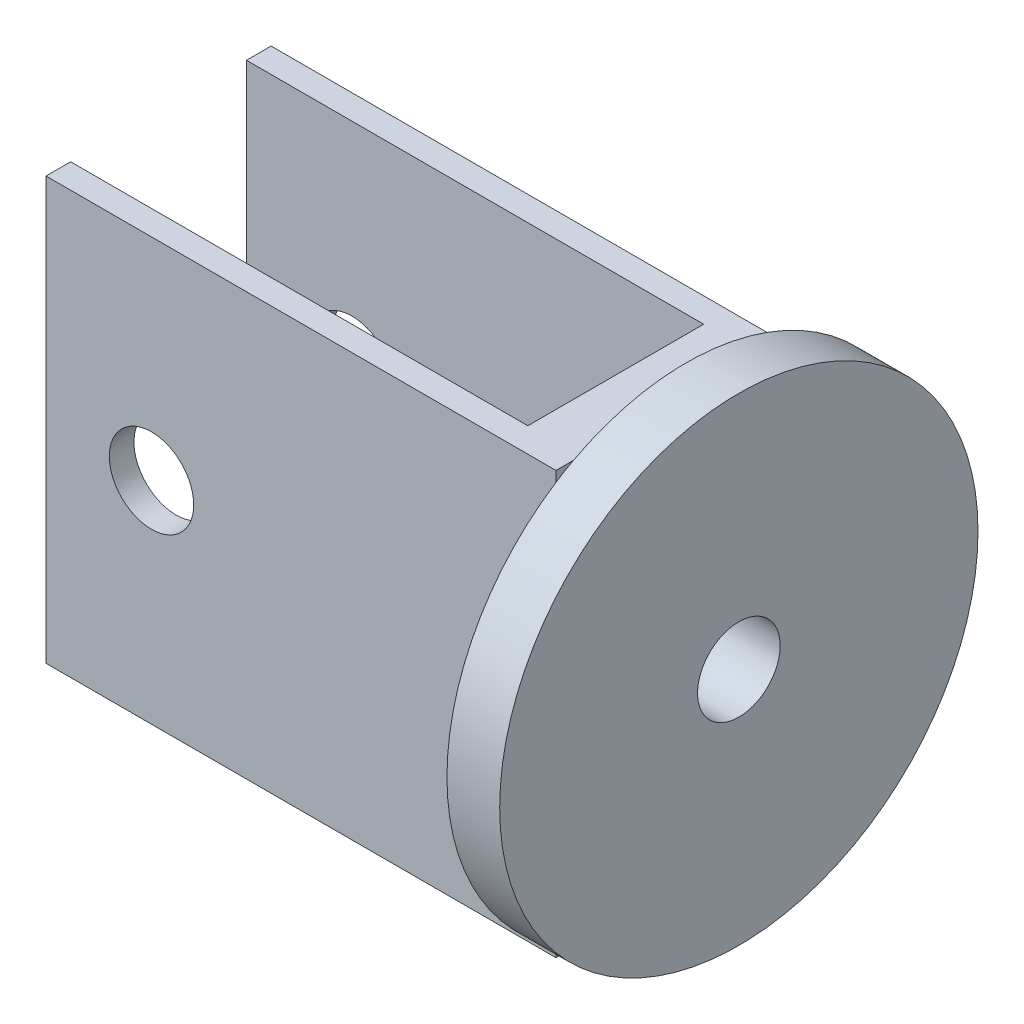
ISO-10303-21;
HEADER;
FILE_DESCRIPTION(('STEP AP214'),'2;1');
FILE_NAME('part.step','',(''),(''),'','','');
FILE_SCHEMA(('AUTOMOTIVE_DESIGN { 1 0 10303 214 1 1 1 1 }'));
ENDSEC;
DATA;
#1=APPLICATION_CONTEXT('core data for automotive mechanical design processes');
#2=APPLICATION_PROTOCOL_DEFINITION('international standard','automotive_design',2000,#1);
#3=PRODUCT_CONTEXT('',#1,'mechanical');
#4=PRODUCT('Part','Part','',(#3));
#5=PRODUCT_RELATED_PRODUCT_CATEGORY('part','',(#4));
#6=PRODUCT_DEFINITION_FORMATION('','',#4);
#7=PRODUCT_DEFINITION_CONTEXT('part definition',#1,'design');
#8=PRODUCT_DEFINITION('design','',#6,#7);
#9=PRODUCT_DEFINITION_SHAPE('','',#8);
#10=(LENGTH_UNIT() NAMED_UNIT(*) SI_UNIT(.MILLI.,.METRE.));
#11=(NAMED_UNIT(*) PLANE_ANGLE_UNIT() SI_UNIT($,.RADIAN.));
#12=(NAMED_UNIT(*) SI_UNIT($,.STERADIAN.) SOLID_ANGLE_UNIT());
#13=UNCERTAINTY_MEASURE_WITH_UNIT(LENGTH_MEASURE(1.E-05),#10,'distance_accuracy_value','');
#14=(GEOMETRIC_REPRESENTATION_CONTEXT(3) GLOBAL_UNCERTAINTY_ASSIGNED_CONTEXT((#13)) GLOBAL_UNIT_ASSIGNED_CONTEXT((#10,
#11,#12)) REPRESENTATION_CONTEXT('',''));
#15=CARTESIAN_POINT('',(0.,0.,0.));
#16=DIRECTION('',(0.,0.,1.));
#17=DIRECTION('',(1.,0.,0.));
#18=AXIS2_PLACEMENT_3D('',#15,#16,#17);
#19=CARTESIAN_POINT('',(231.06736811296,120.,64.6310627072017));
#20=DIRECTION('',(1.,0.,0.));
#21=DIRECTION('',(0.,0.,-1.));
#22=AXIS2_PLACEMENT_3D('',#19,#20,#21);
#23=CYLINDRICAL_SURFACE('',#22,5.875);
#24=CARTESIAN_POINT('',(251.06736811296,120.,64.6310627072017));
#25=DIRECTION('',(1.,0.,0.));
#26=DIRECTION('',(0.,0.,-1.));
#27=AXIS2_PLACEMENT_3D('',#24,#25,#26);
#28=CIRCLE('',#27,5.875);
#29=CARTESIAN_POINT('',(251.06736811296,120.,58.7560627072017));
#30=VERTEX_POINT('',#29);
#31=EDGE_CURVE('E140',#30,#30,#28,.T.);
#32=ORIENTED_EDGE('',*,*,#31,.T.);
#33=EDGE_LOOP('',(#32));
#34=FACE_BOUND('',#33,.T.);
#35=CARTESIAN_POINT('',(238.56736811296,120.,64.6310627072017));
#36=DIRECTION('',(-1.,0.,0.));
#37=DIRECTION('',(0.,0.,1.));
#38=AXIS2_PLACEMENT_3D('',#35,#36,#37);
#39=CIRCLE('',#38,5.875);
#40=CARTESIAN_POINT('',(238.56736811296,120.,70.5060627072017));
#41=VERTEX_POINT('',#40);
#42=EDGE_CURVE('E11',#41,#41,#39,.F.);
#43=ORIENTED_EDGE('',*,*,#42,.F.);
#44=EDGE_LOOP('',(#43));
#45=FACE_BOUND('',#44,.T.);
#46=ADVANCED_FACE('F37',(#34,#45),#23,.F.);
#47=CARTESIAN_POINT('',(243.56736811296,150.,51.1310627072017));
#48=DIRECTION('',(-1.,0.,0.));
#49=DIRECTION('',(0.,0.,1.));
#50=AXIS2_PLACEMENT_3D('',#47,#48,#49);
#51=PLANE('',#50);
#52=CARTESIAN_POINT('',(243.56736811296,120.,64.6310627072018));
#53=DIRECTION('',(1.,0.,0.));
#54=DIRECTION('',(0.,0.,-1.));
#55=AXIS2_PLACEMENT_3D('',#52,#53,#54);
#56=CIRCLE('',#55,34.);
#57=CARTESIAN_POINT('',(243.56736811296,150.,80.6310627072018));
#58=VERTEX_POINT('',#57);
#59=CARTESIAN_POINT('',(243.56736811296,148.526303651192,83.1310627072017));
#60=VERTEX_POINT('',#59);
#61=EDGE_CURVE('E142',#58,#60,#56,.T.);
#62=ORIENTED_EDGE('',*,*,#61,.F.);
#63=DIRECTION('',(0.,0.,-1.));
#64=VECTOR('',#63,1.);
#65=CARTESIAN_POINT('',(243.56736811296,150.,51.1310627072017));
#66=LINE('',#65,#64);
#67=CARTESIAN_POINT('',(243.56736811296,150.,83.1310627072017));
#68=VERTEX_POINT('',#67);
#69=EDGE_CURVE('E227',#68,#58,#66,.T.);
#70=ORIENTED_EDGE('',*,*,#69,.F.);
#71=DIRECTION('',(0.,-1.,0.));
#72=VECTOR('',#71,1.);
#73=CARTESIAN_POINT('',(243.56736811296,150.,83.1310627072017));
#74=LINE('',#73,#72);
#75=EDGE_CURVE('E244',#68,#60,#74,.T.);
#76=ORIENTED_EDGE('',*,*,#75,.T.);
#77=EDGE_LOOP('',(#62,#70,#76));
#78=FACE_BOUND('',#77,.T.);
#79=ADVANCED_FACE('F263',(#78),#51,.F.);
#80=CARTESIAN_POINT('',(243.56736811296,91.4736963488082,83.1310627072017));
#81=VERTEX_POINT('',#80);
#82=CARTESIAN_POINT('',(243.56736811296,90.,80.6310627072017));
#83=VERTEX_POINT('',#82);
#84=EDGE_CURVE('E46',#81,#83,#56,.T.);
#85=ORIENTED_EDGE('',*,*,#84,.F.);
#86=CARTESIAN_POINT('',(243.56736811296,90.,83.1310627072017));
#87=VERTEX_POINT('',#86);
#88=EDGE_CURVE('E116',#81,#87,#74,.T.);
#89=ORIENTED_EDGE('',*,*,#88,.T.);
#90=DIRECTION('',(0.,0.,-1.));
#91=VECTOR('',#90,1.);
#92=CARTESIAN_POINT('',(243.56736811296,90.,51.1310627072017));
#93=LINE('',#92,#91);
#94=EDGE_CURVE('E113',#87,#83,#93,.T.);
#95=ORIENTED_EDGE('',*,*,#94,.T.);
#96=EDGE_LOOP('',(#85,#89,#95));
#97=FACE_BOUND('',#96,.T.);
#98=ADVANCED_FACE('F115',(#97),#51,.F.);
#99=CARTESIAN_POINT('',(236.06736811296,150.,54.6310627072017));
#100=DIRECTION('',(0.,0.,-1.));
#101=DIRECTION('',(-1.,0.,0.));
#102=AXIS2_PLACEMENT_3D('',#99,#100,#101);
#103=PLANE('',#102);
#104=CARTESIAN_POINT('',(186.06736811296,120.,54.6310627072017));
#105=DIRECTION('',(0.,0.,-1.));
#106=DIRECTION('',(-1.,0.,0.));
#107=AXIS2_PLACEMENT_3D('',#104,#105,#106);
#108=CIRCLE('',#107,6.00000000000002);
#109=CARTESIAN_POINT('',(180.06736811296,120.,54.6310627072017));
#110=VERTEX_POINT('',#109);
#111=EDGE_CURVE('E167',#110,#110,#108,.T.);
#112=ORIENTED_EDGE('',*,*,#111,.T.);
#113=EDGE_LOOP('',(#112));
#114=FACE_BOUND('',#113,.T.);
#115=DIRECTION('',(1.,0.,0.));
#116=VECTOR('',#115,1.);
#117=CARTESIAN_POINT('',(236.06736811296,90.,54.6310627072017));
#118=LINE('',#117,#116);
#119=CARTESIAN_POINT('',(171.06736811296,90.,54.6310627072017));
#120=VERTEX_POINT('',#119);
#121=CARTESIAN_POINT('',(236.06736811296,90.,54.6310627072017));
#122=VERTEX_POINT('',#121);
#123=EDGE_CURVE('E154',#120,#122,#118,.T.);
#124=ORIENTED_EDGE('',*,*,#123,.T.);
#125=DIRECTION('',(0.,-1.,0.));
#126=VECTOR('',#125,1.);
#127=CARTESIAN_POINT('',(236.06736811296,150.,54.6310627072017));
#128=LINE('',#127,#126);
#129=CARTESIAN_POINT('',(236.06736811296,150.,54.6310627072017));
#130=VERTEX_POINT('',#129);
#131=EDGE_CURVE('E146',#130,#122,#128,.T.);
#132=ORIENTED_EDGE('',*,*,#131,.F.);
#133=DIRECTION('',(1.,0.,0.));
#134=VECTOR('',#133,1.);
#135=CARTESIAN_POINT('',(236.06736811296,150.,54.6310627072017));
#136=LINE('',#135,#134);
#137=CARTESIAN_POINT('',(171.06736811296,150.,54.6310627072017));
#138=VERTEX_POINT('',#137);
#139=EDGE_CURVE('E215',#138,#130,#136,.T.);
#140=ORIENTED_EDGE('',*,*,#139,.F.);
#141=DIRECTION('',(0.,-1.,0.));
#142=VECTOR('',#141,1.);
#143=CARTESIAN_POINT('',(171.06736811296,150.,54.6310627072017));
#144=LINE('',#143,#142);
#145=EDGE_CURVE('E200',#138,#120,#144,.T.);
#146=ORIENTED_EDGE('',*,*,#145,.T.);
#147=EDGE_LOOP('',(#124,#132,#140,#146));
#148=FACE_BOUND('',#147,.T.);
#149=ADVANCED_FACE('F39',(#114,#148),#103,.F.);
#150=CARTESIAN_POINT('',(236.06736811296,150.,79.6310627072017));
#151=DIRECTION('',(1.,0.,0.));
#152=DIRECTION('',(0.,0.,-1.));
#153=AXIS2_PLACEMENT_3D('',#150,#151,#152);
#154=PLANE('',#153);
#155=DIRECTION('',(0.,0.,1.));
#156=VECTOR('',#155,1.);
#157=CARTESIAN_POINT('',(236.06736811296,90.,79.6310627072017));
#158=LINE('',#157,#156);
#159=CARTESIAN_POINT('',(236.06736811296,90.,79.6310627072017));
#160=VERTEX_POINT('',#159);
#161=EDGE_CURVE('E158',#122,#160,#158,.T.);
#162=ORIENTED_EDGE('',*,*,#161,.T.);
#163=DIRECTION('',(0.,-1.,0.));
#164=VECTOR('',#163,1.);
#165=CARTESIAN_POINT('',(236.06736811296,150.,79.6310627072017));
#166=LINE('',#165,#164);
#167=CARTESIAN_POINT('',(236.06736811296,150.,79.6310627072017));
#168=VERTEX_POINT('',#167);
#169=EDGE_CURVE('E148',#168,#160,#166,.T.);
#170=ORIENTED_EDGE('',*,*,#169,.F.);
#171=DIRECTION('',(0.,0.,1.));
#172=VECTOR('',#171,1.);
#173=CARTESIAN_POINT('',(236.06736811296,150.,79.6310627072017));
#174=LINE('',#173,#172);
#175=EDGE_CURVE('E210',#130,#168,#174,.T.);
#176=ORIENTED_EDGE('',*,*,#175,.F.);
#177=ORIENTED_EDGE('',*,*,#131,.T.);
#178=EDGE_LOOP('',(#162,#170,#176,#177));
#179=FACE_BOUND('',#178,.T.);
#180=CARTESIAN_POINT('',(236.06736811296,120.,64.6310627072017));
#181=DIRECTION('',(-1.,0.,0.));
#182=DIRECTION('',(0.,0.,1.));
#183=AXIS2_PLACEMENT_3D('',#180,#181,#182);
#184=CIRCLE('',#183,2.5);
#185=CARTESIAN_POINT('',(236.06736811296,120.,67.1310627072017));
#186=VERTEX_POINT('',#185);
#187=EDGE_CURVE('E164',#186,#186,#184,.T.);
#188=ORIENTED_EDGE('',*,*,#187,.F.);
#189=EDGE_LOOP('',(#188));
#190=FACE_BOUND('',#189,.T.);
#191=ADVANCED_FACE('F195',(#179,#190),#154,.F.);
#192=CARTESIAN_POINT('',(171.06736811296,150.,79.6310627072017));
#193=DIRECTION('',(0.,0.,1.));
#194=DIRECTION('',(1.,0.,0.));
#195=AXIS2_PLACEMENT_3D('',#192,#193,#194);
#196=PLANE('',#195);
#197=CARTESIAN_POINT('',(186.06736811296,120.,79.6310627072017));
#198=DIRECTION('',(0.,0.,1.));
#199=DIRECTION('',(1.,0.,0.));
#200=AXIS2_PLACEMENT_3D('',#197,#198,#199);
#201=CIRCLE('',#200,6.00000000000002);
#202=CARTESIAN_POINT('',(192.06736811296,120.,79.6310627072017));
#203=VERTEX_POINT('',#202);
#204=EDGE_CURVE('E172',#203,#203,#201,.T.);
#205=ORIENTED_EDGE('',*,*,#204,.T.);
#206=EDGE_LOOP('',(#205));
#207=FACE_BOUND('',#206,.T.);
#208=DIRECTION('',(-1.,0.,0.));
#209=VECTOR('',#208,1.);
#210=CARTESIAN_POINT('',(171.06736811296,90.,79.6310627072017));
#211=LINE('',#210,#209);
#212=CARTESIAN_POINT('',(171.06736811296,90.,79.6310627072017));
#213=VERTEX_POINT('',#212);
#214=EDGE_CURVE('E204',#160,#213,#211,.T.);
#215=ORIENTED_EDGE('',*,*,#214,.T.);
#216=DIRECTION('',(0.,-1.,0.));
#217=VECTOR('',#216,1.);
#218=CARTESIAN_POINT('',(171.06736811296,150.,79.6310627072017));
#219=LINE('',#218,#217);
#220=CARTESIAN_POINT('',(171.06736811296,150.,79.6310627072017));
#221=VERTEX_POINT('',#220);
#222=EDGE_CURVE('E249',#221,#213,#219,.T.);
#223=ORIENTED_EDGE('',*,*,#222,.F.);
#224=DIRECTION('',(-1.,0.,0.));
#225=VECTOR('',#224,1.);
#226=CARTESIAN_POINT('',(171.06736811296,150.,79.6310627072017));
#227=LINE('',#226,#225);
#228=EDGE_CURVE('E214',#168,#221,#227,.T.);
#229=ORIENTED_EDGE('',*,*,#228,.F.);
#230=ORIENTED_EDGE('',*,*,#169,.T.);
#231=EDGE_LOOP('',(#215,#223,#229,#230));
#232=FACE_BOUND('',#231,.T.);
#233=ADVANCED_FACE('F253',(#207,#232),#196,.F.);
#234=CARTESIAN_POINT('',(171.06736811296,150.,83.1310627072017));
#235=DIRECTION('',(1.,0.,0.));
#236=DIRECTION('',(0.,0.,-1.));
#237=AXIS2_PLACEMENT_3D('',#234,#235,#236);
#238=PLANE('',#237);
#239=DIRECTION('',(0.,0.,1.));
#240=VECTOR('',#239,1.);
#241=CARTESIAN_POINT('',(171.06736811296,90.,83.1310627072017));
#242=LINE('',#241,#240);
#243=CARTESIAN_POINT('',(171.06736811296,90.,83.1310627072017));
#244=VERTEX_POINT('',#243);
#245=EDGE_CURVE('E234',#213,#244,#242,.T.);
#246=ORIENTED_EDGE('',*,*,#245,.T.);
#247=DIRECTION('',(0.,-1.,0.));
#248=VECTOR('',#247,1.);
#249=CARTESIAN_POINT('',(171.06736811296,150.,83.1310627072017));
#250=LINE('',#249,#248);
#251=CARTESIAN_POINT('',(171.06736811296,150.,83.1310627072017));
#252=VERTEX_POINT('',#251);
#253=EDGE_CURVE('E246',#252,#244,#250,.T.);
#254=ORIENTED_EDGE('',*,*,#253,.F.);
#255=DIRECTION('',(0.,0.,1.));
#256=VECTOR('',#255,1.);
#257=CARTESIAN_POINT('',(171.06736811296,150.,83.1310627072017));
#258=LINE('',#257,#256);
#259=EDGE_CURVE('E223',#221,#252,#258,.T.);
#260=ORIENTED_EDGE('',*,*,#259,.F.);
#261=ORIENTED_EDGE('',*,*,#222,.T.);
#262=EDGE_LOOP('',(#246,#254,#260,#261));
#263=FACE_BOUND('',#262,.T.);
#264=ADVANCED_FACE('F259',(#263),#238,.F.);
#265=CARTESIAN_POINT('',(243.56736811296,150.,83.1310627072017));
#266=DIRECTION('',(0.,0.,-1.));
#267=DIRECTION('',(-1.,0.,0.));
#268=AXIS2_PLACEMENT_3D('',#265,#266,#267);
#269=PLANE('',#268);
#270=CARTESIAN_POINT('',(186.06736811296,120.,83.1310627072017));
#271=DIRECTION('',(0.,0.,1.));
#272=DIRECTION('',(1.,0.,0.));
#273=AXIS2_PLACEMENT_3D('',#270,#271,#272);
#274=CIRCLE('',#273,6.00000000000002);
#275=CARTESIAN_POINT('',(192.06736811296,120.,83.1310627072017));
#276=VERTEX_POINT('',#275);
#277=EDGE_CURVE('E175',#276,#276,#274,.T.);
#278=ORIENTED_EDGE('',*,*,#277,.F.);
#279=EDGE_LOOP('',(#278));
#280=FACE_BOUND('',#279,.T.);
#281=DIRECTION('',(1.,0.,0.));
#282=VECTOR('',#281,1.);
#283=CARTESIAN_POINT('',(243.56736811296,90.,83.1310627072017));
#284=LINE('',#283,#282);
#285=EDGE_CURVE('E131',#244,#87,#284,.T.);
#286=ORIENTED_EDGE('',*,*,#285,.T.);
#287=ORIENTED_EDGE('',*,*,#88,.F.);
#288=EDGE_CURVE('E59',#60,#81,#74,.T.);
#289=ORIENTED_EDGE('',*,*,#288,.F.);
#290=ORIENTED_EDGE('',*,*,#75,.F.);
#291=DIRECTION('',(1.,0.,0.));
#292=VECTOR('',#291,1.);
#293=CARTESIAN_POINT('',(243.56736811296,150.,83.1310627072017));
#294=LINE('',#293,#292);
#295=EDGE_CURVE('E225',#252,#68,#294,.T.);
#296=ORIENTED_EDGE('',*,*,#295,.F.);
#297=ORIENTED_EDGE('',*,*,#253,.T.);
#298=EDGE_LOOP('',(#286,#287,#289,#290,#296,#297));
#299=FACE_BOUND('',#298,.T.);
#300=ADVANCED_FACE('F260',(#280,#299),#269,.F.);
#301=CARTESIAN_POINT('',(171.06736811296,150.,51.1310627072017));
#302=DIRECTION('',(0.,0.,1.));
#303=DIRECTION('',(1.,0.,0.));
#304=AXIS2_PLACEMENT_3D('',#301,#302,#303);
#305=PLANE('',#304);
#306=CARTESIAN_POINT('',(186.06736811296,120.,51.1310627072017));
#307=DIRECTION('',(0.,0.,1.));
#308=DIRECTION('',(1.,0.,0.));
#309=AXIS2_PLACEMENT_3D('',#306,#307,#308);
#310=CIRCLE('',#309,6.00000000000002);
#311=CARTESIAN_POINT('',(192.06736811296,120.,51.1310627072017));
#312=VERTEX_POINT('',#311);
#313=EDGE_CURVE('E41',#312,#312,#310,.T.);
#314=ORIENTED_EDGE('',*,*,#313,.T.);
#315=EDGE_LOOP('',(#314));
#316=FACE_BOUND('',#315,.T.);
#317=DIRECTION('',(-1.,0.,0.));
#318=VECTOR('',#317,1.);
#319=CARTESIAN_POINT('',(171.06736811296,90.,51.1310627072017));
#320=LINE('',#319,#318);
#321=CARTESIAN_POINT('',(243.56736811296,90.,51.1310627072017));
#322=VERTEX_POINT('',#321);
#323=CARTESIAN_POINT('',(171.06736811296,90.,51.1310627072017));
#324=VERTEX_POINT('',#323);
#325=EDGE_CURVE('E120',#322,#324,#320,.T.);
#326=ORIENTED_EDGE('',*,*,#325,.T.);
#327=DIRECTION('',(0.,-1.,0.));
#328=VECTOR('',#327,1.);
#329=CARTESIAN_POINT('',(171.06736811296,150.,51.1310627072017));
#330=LINE('',#329,#328);
#331=CARTESIAN_POINT('',(171.06736811296,150.,51.1310627072017));
#332=VERTEX_POINT('',#331);
#333=EDGE_CURVE('E239',#332,#324,#330,.T.);
#334=ORIENTED_EDGE('',*,*,#333,.F.);
#335=DIRECTION('',(-1.,0.,0.));
#336=VECTOR('',#335,1.);
#337=CARTESIAN_POINT('',(171.06736811296,150.,51.1310627072017));
#338=LINE('',#337,#336);
#339=CARTESIAN_POINT('',(243.56736811296,150.,51.1310627072017));
#340=VERTEX_POINT('',#339);
#341=EDGE_CURVE('E230',#340,#332,#338,.T.);
#342=ORIENTED_EDGE('',*,*,#341,.F.);
#343=DIRECTION('',(0.,-1.,0.));
#344=VECTOR('',#343,1.);
#345=CARTESIAN_POINT('',(243.56736811296,150.,51.1310627072017));
#346=LINE('',#345,#344);
#347=EDGE_CURVE('E242',#340,#322,#346,.T.);
#348=ORIENTED_EDGE('',*,*,#347,.T.);
#349=EDGE_LOOP('',(#326,#334,#342,#348));
#350=FACE_BOUND('',#349,.T.);
#351=ADVANCED_FACE('F182',(#316,#350),#305,.F.);
#352=CARTESIAN_POINT('',(171.06736811296,150.,54.6310627072017));
#353=DIRECTION('',(1.,0.,0.));
#354=DIRECTION('',(0.,0.,-1.));
#355=AXIS2_PLACEMENT_3D('',#352,#353,#354);
#356=PLANE('',#355);
#357=DIRECTION('',(0.,0.,1.));
#358=VECTOR('',#357,1.);
#359=CARTESIAN_POINT('',(171.06736811296,90.,54.6310627072017));
#360=LINE('',#359,#358);
#361=EDGE_CURVE('E201',#324,#120,#360,.T.);
#362=ORIENTED_EDGE('',*,*,#361,.T.);
#363=ORIENTED_EDGE('',*,*,#145,.F.);
#364=DIRECTION('',(0.,0.,1.));
#365=VECTOR('',#364,1.);
#366=CARTESIAN_POINT('',(171.06736811296,150.,54.6310627072017));
#367=LINE('',#366,#365);
#368=EDGE_CURVE('E219',#332,#138,#367,.T.);
#369=ORIENTED_EDGE('',*,*,#368,.F.);
#370=ORIENTED_EDGE('',*,*,#333,.T.);
#371=EDGE_LOOP('',(#362,#363,#369,#370));
#372=FACE_BOUND('',#371,.T.);
#373=ADVANCED_FACE('F267',(#372),#356,.F.);
#374=CARTESIAN_POINT('',(171.06736811296,150.,49.6310627072017));
#375=DIRECTION('',(0.,-1.,0.));
#376=DIRECTION('',(0.,0.,-1.));
#377=AXIS2_PLACEMENT_3D('',#374,#375,#376);
#378=PLANE('',#377);
#379=ORIENTED_EDGE('',*,*,#139,.T.);
#380=ORIENTED_EDGE('',*,*,#175,.T.);
#381=ORIENTED_EDGE('',*,*,#228,.T.);
#382=ORIENTED_EDGE('',*,*,#259,.T.);
#383=ORIENTED_EDGE('',*,*,#295,.T.);
#384=ORIENTED_EDGE('',*,*,#69,.T.);
#385=EDGE_CURVE('E136',#58,#340,#66,.T.);
#386=ORIENTED_EDGE('',*,*,#385,.T.);
#387=ORIENTED_EDGE('',*,*,#341,.T.);
#388=ORIENTED_EDGE('',*,*,#368,.T.);
#389=EDGE_LOOP('',(#379,#380,#381,#382,#383,#384,#386,#387,#388));
#390=FACE_BOUND('',#389,.T.);
#391=ADVANCED_FACE('F217',(#390),#378,.F.);
#392=CARTESIAN_POINT('',(171.06736811296,90.,49.6310627072017));
#393=DIRECTION('',(0.,-1.,0.));
#394=DIRECTION('',(0.,0.,-1.));
#395=AXIS2_PLACEMENT_3D('',#392,#393,#394);
#396=PLANE('',#395);
#397=ORIENTED_EDGE('',*,*,#123,.F.);
#398=ORIENTED_EDGE('',*,*,#361,.F.);
#399=ORIENTED_EDGE('',*,*,#325,.F.);
#400=EDGE_CURVE('E121',#83,#322,#93,.T.);
#401=ORIENTED_EDGE('',*,*,#400,.F.);
#402=ORIENTED_EDGE('',*,*,#94,.F.);
#403=ORIENTED_EDGE('',*,*,#285,.F.);
#404=ORIENTED_EDGE('',*,*,#245,.F.);
#405=ORIENTED_EDGE('',*,*,#214,.F.);
#406=ORIENTED_EDGE('',*,*,#161,.F.);
#407=EDGE_LOOP('',(#397,#398,#399,#401,#402,#403,#404,#405,#406));
#408=FACE_BOUND('',#407,.T.);
#409=ADVANCED_FACE('F127',(#408),#396,.T.);
#410=CARTESIAN_POINT('',(243.56736811296,120.,64.6310627072018));
#411=DIRECTION('',(1.,0.,0.));
#412=DIRECTION('',(0.,0.,-1.));
#413=AXIS2_PLACEMENT_3D('',#410,#411,#412);
#414=PLANE('',#413);
#415=EDGE_CURVE('E134',#83,#58,#56,.T.);
#416=ORIENTED_EDGE('',*,*,#415,.F.);
#417=ORIENTED_EDGE('',*,*,#400,.T.);
#418=ORIENTED_EDGE('',*,*,#347,.F.);
#419=ORIENTED_EDGE('',*,*,#385,.F.);
#420=EDGE_LOOP('',(#416,#417,#418,#419));
#421=FACE_BOUND('',#420,.T.);
#422=ADVANCED_FACE('F135',(#421),#414,.F.);
#423=EDGE_CURVE('E139',#60,#81,#56,.T.);
#424=ORIENTED_EDGE('',*,*,#423,.F.);
#425=ORIENTED_EDGE('',*,*,#288,.T.);
#426=EDGE_LOOP('',(#424,#425));
#427=FACE_BOUND('',#426,.T.);
#428=ADVANCED_FACE('F295',(#427),#414,.F.);
#429=CARTESIAN_POINT('',(251.06736811296,120.,64.6310627072018));
#430=DIRECTION('',(-1.,0.,0.));
#431=DIRECTION('',(0.,0.,1.));
#432=AXIS2_PLACEMENT_3D('',#429,#430,#431);
#433=CYLINDRICAL_SURFACE('',#432,34.);
#434=CARTESIAN_POINT('',(251.06736811296,120.,64.6310627072018));
#435=DIRECTION('',(1.,0.,0.));
#436=DIRECTION('',(0.,0.,-1.));
#437=AXIS2_PLACEMENT_3D('',#434,#435,#436);
#438=CIRCLE('',#437,34.);
#439=CARTESIAN_POINT('',(251.06736811296,120.,30.6310627072018));
#440=VERTEX_POINT('',#439);
#441=EDGE_CURVE('E152',#440,#440,#438,.T.);
#442=ORIENTED_EDGE('',*,*,#441,.F.);
#443=EDGE_LOOP('',(#442));
#444=FACE_BOUND('',#443,.T.);
#445=ORIENTED_EDGE('',*,*,#61,.T.);
#446=ORIENTED_EDGE('',*,*,#423,.T.);
#447=ORIENTED_EDGE('',*,*,#84,.T.);
#448=ORIENTED_EDGE('',*,*,#415,.T.);
#449=EDGE_LOOP('',(#445,#446,#447,#448));
#450=FACE_BOUND('',#449,.T.);
#451=ADVANCED_FACE('F144',(#444,#450),#433,.T.);
#452=CARTESIAN_POINT('',(251.06736811296,120.,64.6310627072018));
#453=DIRECTION('',(1.,0.,0.));
#454=DIRECTION('',(0.,0.,-1.));
#455=AXIS2_PLACEMENT_3D('',#452,#453,#454);
#456=PLANE('',#455);
#457=ORIENTED_EDGE('',*,*,#31,.F.);
#458=EDGE_LOOP('',(#457));
#459=FACE_BOUND('',#458,.T.);
#460=ORIENTED_EDGE('',*,*,#441,.T.);
#461=EDGE_LOOP('',(#460));
#462=FACE_BOUND('',#461,.T.);
#463=ADVANCED_FACE('F289',(#459,#462),#456,.T.);
#464=CARTESIAN_POINT('',(238.56736811296,120.,64.6310627072017));
#465=DIRECTION('',(-1.,0.,0.));
#466=DIRECTION('',(0.,0.,1.));
#467=AXIS2_PLACEMENT_3D('',#464,#465,#466);
#468=PLANE('',#467);
#469=CARTESIAN_POINT('',(238.56736811296,120.,64.6310627072017));
#470=DIRECTION('',(-1.,0.,0.));
#471=DIRECTION('',(0.,0.,1.));
#472=AXIS2_PLACEMENT_3D('',#469,#470,#471);
#473=CIRCLE('',#472,2.5);
#474=CARTESIAN_POINT('',(238.56736811296,120.,67.1310627072017));
#475=VERTEX_POINT('',#474);
#476=EDGE_CURVE('E163',#475,#475,#473,.T.);
#477=ORIENTED_EDGE('',*,*,#476,.T.);
#478=EDGE_LOOP('',(#477));
#479=FACE_BOUND('',#478,.T.);
#480=ORIENTED_EDGE('',*,*,#42,.T.);
#481=EDGE_LOOP('',(#480));
#482=FACE_BOUND('',#481,.T.);
#483=ADVANCED_FACE('F287',(#479,#482),#468,.F.);
#484=CARTESIAN_POINT('',(238.56736811296,120.,64.6310627072017));
#485=DIRECTION('',(-1.,0.,0.));
#486=DIRECTION('',(0.,0.,1.));
#487=AXIS2_PLACEMENT_3D('',#484,#485,#486);
#488=CYLINDRICAL_SURFACE('',#487,2.5);
#489=ORIENTED_EDGE('',*,*,#476,.F.);
#490=EDGE_LOOP('',(#489));
#491=FACE_BOUND('',#490,.T.);
#492=ORIENTED_EDGE('',*,*,#187,.T.);
#493=EDGE_LOOP('',(#492));
#494=FACE_BOUND('',#493,.T.);
#495=ADVANCED_FACE('F189',(#491,#494),#488,.F.);
#496=CARTESIAN_POINT('',(186.06736811296,120.,-116.868937292798));
#497=DIRECTION('',(0.,0.,1.));
#498=DIRECTION('',(1.,0.,0.));
#499=AXIS2_PLACEMENT_3D('',#496,#497,#498);
#500=CYLINDRICAL_SURFACE('',#499,6.00000000000002);
#501=ORIENTED_EDGE('',*,*,#313,.F.);
#502=EDGE_LOOP('',(#501));
#503=FACE_BOUND('',#502,.T.);
#504=ORIENTED_EDGE('',*,*,#111,.F.);
#505=EDGE_LOOP('',(#504));
#506=FACE_BOUND('',#505,.T.);
#507=ADVANCED_FACE('F185',(#503,#506),#500,.F.);
#508=ORIENTED_EDGE('',*,*,#277,.T.);
#509=EDGE_LOOP('',(#508));
#510=FACE_BOUND('',#509,.T.);
#511=ORIENTED_EDGE('',*,*,#204,.F.);
#512=EDGE_LOOP('',(#511));
#513=FACE_BOUND('',#512,.T.);
#514=ADVANCED_FACE('F188',(#510,#513),#500,.F.);
#515=CLOSED_SHELL('',(#46,#79,#98,#149,#191,#233,#264,#300,#351,#373,#391,#409,#422,#428,#451,
#463,#483,#495,#507,#514));
#516=MANIFOLD_SOLID_BREP('B2',#515);
#517=ADVANCED_BREP_SHAPE_REPRESENTATION('',(#18,#516),#14);
#518=SHAPE_DEFINITION_REPRESENTATION(#9,#517);
ENDSEC;
END-ISO-10303-21;
